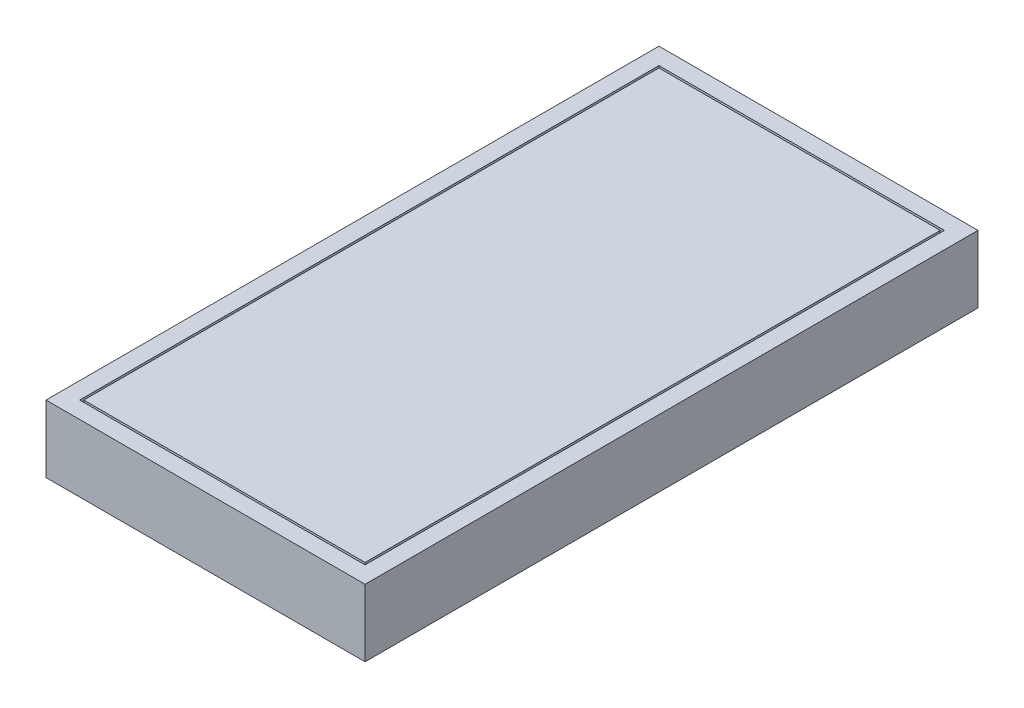
ISO-10303-21;
HEADER;
FILE_DESCRIPTION(('STEP AP214'),'2;1');
FILE_NAME('part.step','',(''),(''),'','','');
FILE_SCHEMA(('AUTOMOTIVE_DESIGN { 1 0 10303 214 1 1 1 1 }'));
ENDSEC;
DATA;
#1=APPLICATION_CONTEXT('core data for automotive mechanical design processes');
#2=APPLICATION_PROTOCOL_DEFINITION('international standard','automotive_design',2000,#1);
#3=PRODUCT_CONTEXT('',#1,'mechanical');
#4=PRODUCT('Part','Part','',(#3));
#5=PRODUCT_RELATED_PRODUCT_CATEGORY('part','',(#4));
#6=PRODUCT_DEFINITION_FORMATION('','',#4);
#7=PRODUCT_DEFINITION_CONTEXT('part definition',#1,'design');
#8=PRODUCT_DEFINITION('design','',#6,#7);
#9=PRODUCT_DEFINITION_SHAPE('','',#8);
#10=(LENGTH_UNIT() NAMED_UNIT(*) SI_UNIT(.MILLI.,.METRE.));
#11=(NAMED_UNIT(*) PLANE_ANGLE_UNIT() SI_UNIT($,.RADIAN.));
#12=(NAMED_UNIT(*) SI_UNIT($,.STERADIAN.) SOLID_ANGLE_UNIT());
#13=UNCERTAINTY_MEASURE_WITH_UNIT(LENGTH_MEASURE(1.E-05),#10,'distance_accuracy_value','');
#14=(GEOMETRIC_REPRESENTATION_CONTEXT(3) GLOBAL_UNCERTAINTY_ASSIGNED_CONTEXT((#13)) GLOBAL_UNIT_ASSIGNED_CONTEXT((#10,
#11,#12)) REPRESENTATION_CONTEXT('',''));
#15=CARTESIAN_POINT('',(0.,0.,0.));
#16=DIRECTION('',(0.,0.,1.));
#17=DIRECTION('',(1.,0.,0.));
#18=AXIS2_PLACEMENT_3D('',#15,#16,#17);
#19=CARTESIAN_POINT('',(0.,8.99999999999999,0.));
#20=DIRECTION('',(0.,1.,0.));
#21=DIRECTION('',(0.,0.,1.));
#22=AXIS2_PLACEMENT_3D('',#19,#20,#21);
#23=PLANE('',#22);
#24=DIRECTION('',(0.,0.,1.));
#25=VECTOR('',#24,1.);
#26=CARTESIAN_POINT('',(-170.,8.99999999999999,20.));
#27=LINE('',#26,#25);
#28=CARTESIAN_POINT('',(-170.,8.99999999999999,20.));
#29=VERTEX_POINT('',#28);
#30=CARTESIAN_POINT('',(-170.,8.99999999999999,710.));
#31=VERTEX_POINT('',#30);
#32=EDGE_CURVE('E156',#29,#31,#27,.T.);
#33=ORIENTED_EDGE('',*,*,#32,.T.);
#34=DIRECTION('',(1.,0.,0.));
#35=VECTOR('',#34,1.);
#36=CARTESIAN_POINT('',(-170.,8.99999999999999,710.));
#37=LINE('',#36,#35);
#38=CARTESIAN_POINT('',(170.,8.99999999999999,710.));
#39=VERTEX_POINT('',#38);
#40=EDGE_CURVE('E159',#31,#39,#37,.T.);
#41=ORIENTED_EDGE('',*,*,#40,.T.);
#42=DIRECTION('',(0.,0.,-1.));
#43=VECTOR('',#42,1.);
#44=CARTESIAN_POINT('',(170.,8.99999999999999,710.));
#45=LINE('',#44,#43);
#46=CARTESIAN_POINT('',(170.,8.99999999999999,20.));
#47=VERTEX_POINT('',#46);
#48=EDGE_CURVE('E163',#39,#47,#45,.T.);
#49=ORIENTED_EDGE('',*,*,#48,.T.);
#50=DIRECTION('',(-1.,0.,0.));
#51=VECTOR('',#50,1.);
#52=CARTESIAN_POINT('',(170.,8.99999999999999,20.));
#53=LINE('',#52,#51);
#54=EDGE_CURVE('E166',#47,#29,#53,.T.);
#55=ORIENTED_EDGE('',*,*,#54,.T.);
#56=EDGE_LOOP('',(#33,#41,#49,#55));
#57=FACE_BOUND('',#56,.T.);
#58=DIRECTION('',(0.,0.,-1.));
#59=VECTOR('',#58,1.);
#60=CARTESIAN_POINT('',(167.5,8.99999999999999,22.5));
#61=LINE('',#60,#59);
#62=CARTESIAN_POINT('',(167.5,8.99999999999999,707.5));
#63=VERTEX_POINT('',#62);
#64=CARTESIAN_POINT('',(167.5,8.99999999999999,22.5));
#65=VERTEX_POINT('',#64);
#66=EDGE_CURVE('E373',#63,#65,#61,.T.);
#67=ORIENTED_EDGE('',*,*,#66,.F.);
#68=DIRECTION('',(1.,0.,0.));
#69=VECTOR('',#68,1.);
#70=CARTESIAN_POINT('',(167.5,8.99999999999999,707.5));
#71=LINE('',#70,#69);
#72=CARTESIAN_POINT('',(-167.5,8.99999999999999,707.5));
#73=VERTEX_POINT('',#72);
#74=EDGE_CURVE('E148',#73,#63,#71,.T.);
#75=ORIENTED_EDGE('',*,*,#74,.F.);
#76=DIRECTION('',(0.,0.,1.));
#77=VECTOR('',#76,1.);
#78=CARTESIAN_POINT('',(-167.5,8.99999999999999,707.5));
#79=LINE('',#78,#77);
#80=CARTESIAN_POINT('',(-167.5,8.99999999999999,22.5));
#81=VERTEX_POINT('',#80);
#82=EDGE_CURVE('E144',#81,#73,#79,.T.);
#83=ORIENTED_EDGE('',*,*,#82,.F.);
#84=DIRECTION('',(-1.,0.,0.));
#85=VECTOR('',#84,1.);
#86=CARTESIAN_POINT('',(-167.5,8.99999999999999,22.5));
#87=LINE('',#86,#85);
#88=EDGE_CURVE('E370',#65,#81,#87,.T.);
#89=ORIENTED_EDGE('',*,*,#88,.F.);
#90=EDGE_LOOP('',(#67,#75,#83,#89));
#91=FACE_BOUND('',#90,.T.);
#92=ADVANCED_FACE('F35',(#57,#91),#23,.T.);
#93=CARTESIAN_POINT('',(-190.,20.,730.));
#94=DIRECTION('',(-1.,0.,0.));
#95=DIRECTION('',(0.,0.,1.));
#96=AXIS2_PLACEMENT_3D('',#93,#94,#95);
#97=PLANE('',#96);
#98=DIRECTION('',(0.,0.,-1.));
#99=VECTOR('',#98,1.);
#100=CARTESIAN_POINT('',(-190.,-60.,730.));
#101=LINE('',#100,#99);
#102=CARTESIAN_POINT('',(-190.,-60.,730.));
#103=VERTEX_POINT('',#102);
#104=CARTESIAN_POINT('',(-190.,-60.,0.));
#105=VERTEX_POINT('',#104);
#106=EDGE_CURVE('E179',#103,#105,#101,.T.);
#107=ORIENTED_EDGE('',*,*,#106,.F.);
#108=DIRECTION('',(0.,-1.,0.));
#109=VECTOR('',#108,1.);
#110=CARTESIAN_POINT('',(-190.,20.,730.));
#111=LINE('',#110,#109);
#112=CARTESIAN_POINT('',(-190.,20.,730.));
#113=VERTEX_POINT('',#112);
#114=EDGE_CURVE('E11',#113,#103,#111,.T.);
#115=ORIENTED_EDGE('',*,*,#114,.F.);
#116=DIRECTION('',(0.,0.,-1.));
#117=VECTOR('',#116,1.);
#118=CARTESIAN_POINT('',(-190.,20.,730.));
#119=LINE('',#118,#117);
#120=CARTESIAN_POINT('',(-190.,20.,0.));
#121=VERTEX_POINT('',#120);
#122=EDGE_CURVE('E185',#113,#121,#119,.T.);
#123=ORIENTED_EDGE('',*,*,#122,.T.);
#124=DIRECTION('',(0.,-1.,0.));
#125=VECTOR('',#124,1.);
#126=CARTESIAN_POINT('',(-190.,20.,0.));
#127=LINE('',#126,#125);
#128=EDGE_CURVE('E39',#121,#105,#127,.T.);
#129=ORIENTED_EDGE('',*,*,#128,.T.);
#130=EDGE_LOOP('',(#107,#115,#123,#129));
#131=FACE_BOUND('',#130,.T.);
#132=ADVANCED_FACE('F37',(#131),#97,.T.);
#133=CARTESIAN_POINT('',(190.,20.,730.));
#134=DIRECTION('',(0.,0.,1.));
#135=DIRECTION('',(1.,0.,0.));
#136=AXIS2_PLACEMENT_3D('',#133,#134,#135);
#137=PLANE('',#136);
#138=DIRECTION('',(-1.,0.,0.));
#139=VECTOR('',#138,1.);
#140=CARTESIAN_POINT('',(190.,-60.,730.));
#141=LINE('',#140,#139);
#142=CARTESIAN_POINT('',(190.,-60.,730.));
#143=VERTEX_POINT('',#142);
#144=EDGE_CURVE('E189',#143,#103,#141,.T.);
#145=ORIENTED_EDGE('',*,*,#144,.F.);
#146=DIRECTION('',(0.,-1.,0.));
#147=VECTOR('',#146,1.);
#148=CARTESIAN_POINT('',(190.,20.,730.));
#149=LINE('',#148,#147);
#150=CARTESIAN_POINT('',(190.,20.,730.));
#151=VERTEX_POINT('',#150);
#152=EDGE_CURVE('E44',#151,#143,#149,.T.);
#153=ORIENTED_EDGE('',*,*,#152,.F.);
#154=DIRECTION('',(-1.,0.,0.));
#155=VECTOR('',#154,1.);
#156=CARTESIAN_POINT('',(190.,20.,730.));
#157=LINE('',#156,#155);
#158=EDGE_CURVE('E195',#151,#113,#157,.T.);
#159=ORIENTED_EDGE('',*,*,#158,.T.);
#160=ORIENTED_EDGE('',*,*,#114,.T.);
#161=EDGE_LOOP('',(#145,#153,#159,#160));
#162=FACE_BOUND('',#161,.T.);
#163=ADVANCED_FACE('F221',(#162),#137,.T.);
#164=CARTESIAN_POINT('',(190.,20.,0.));
#165=DIRECTION('',(1.,0.,0.));
#166=DIRECTION('',(0.,0.,-1.));
#167=AXIS2_PLACEMENT_3D('',#164,#165,#166);
#168=PLANE('',#167);
#169=DIRECTION('',(0.,0.,1.));
#170=VECTOR('',#169,1.);
#171=CARTESIAN_POINT('',(190.,-60.,0.));
#172=LINE('',#171,#170);
#173=CARTESIAN_POINT('',(190.,-60.,0.));
#174=VERTEX_POINT('',#173);
#175=EDGE_CURVE('E203',#174,#143,#172,.T.);
#176=ORIENTED_EDGE('',*,*,#175,.F.);
#177=DIRECTION('',(0.,-1.,0.));
#178=VECTOR('',#177,1.);
#179=CARTESIAN_POINT('',(190.,20.,0.));
#180=LINE('',#179,#178);
#181=CARTESIAN_POINT('',(190.,20.,0.));
#182=VERTEX_POINT('',#181);
#183=EDGE_CURVE('E208',#182,#174,#180,.T.);
#184=ORIENTED_EDGE('',*,*,#183,.F.);
#185=DIRECTION('',(0.,0.,1.));
#186=VECTOR('',#185,1.);
#187=CARTESIAN_POINT('',(190.,20.,0.));
#188=LINE('',#187,#186);
#189=EDGE_CURVE('E192',#182,#151,#188,.T.);
#190=ORIENTED_EDGE('',*,*,#189,.T.);
#191=ORIENTED_EDGE('',*,*,#152,.T.);
#192=EDGE_LOOP('',(#176,#184,#190,#191));
#193=FACE_BOUND('',#192,.T.);
#194=ADVANCED_FACE('F227',(#193),#168,.T.);
#195=CARTESIAN_POINT('',(-190.,20.,0.));
#196=DIRECTION('',(0.,0.,-1.));
#197=DIRECTION('',(-1.,0.,0.));
#198=AXIS2_PLACEMENT_3D('',#195,#196,#197);
#199=PLANE('',#198);
#200=DIRECTION('',(1.,0.,0.));
#201=VECTOR('',#200,1.);
#202=CARTESIAN_POINT('',(-190.,-60.,0.));
#203=LINE('',#202,#201);
#204=EDGE_CURVE('E200',#105,#174,#203,.T.);
#205=ORIENTED_EDGE('',*,*,#204,.F.);
#206=ORIENTED_EDGE('',*,*,#128,.F.);
#207=DIRECTION('',(1.,0.,0.));
#208=VECTOR('',#207,1.);
#209=CARTESIAN_POINT('',(-190.,20.,0.));
#210=LINE('',#209,#208);
#211=EDGE_CURVE('E188',#121,#182,#210,.T.);
#212=ORIENTED_EDGE('',*,*,#211,.T.);
#213=ORIENTED_EDGE('',*,*,#183,.T.);
#214=EDGE_LOOP('',(#205,#206,#212,#213));
#215=FACE_BOUND('',#214,.T.);
#216=ADVANCED_FACE('F216',(#215),#199,.T.);
#217=CARTESIAN_POINT('',(0.,20.,0.));
#218=DIRECTION('',(0.,-1.,0.));
#219=DIRECTION('',(0.,0.,-1.));
#220=AXIS2_PLACEMENT_3D('',#217,#218,#219);
#221=PLANE('',#220);
#222=DIRECTION('',(1.,0.,0.));
#223=VECTOR('',#222,1.);
#224=CARTESIAN_POINT('',(-170.,20.,710.));
#225=LINE('',#224,#223);
#226=CARTESIAN_POINT('',(-170.,20.,710.));
#227=VERTEX_POINT('',#226);
#228=CARTESIAN_POINT('',(170.,20.,710.));
#229=VERTEX_POINT('',#228);
#230=EDGE_CURVE('E151',#227,#229,#225,.T.);
#231=ORIENTED_EDGE('',*,*,#230,.F.);
#232=DIRECTION('',(0.,0.,1.));
#233=VECTOR('',#232,1.);
#234=CARTESIAN_POINT('',(-170.,20.,20.));
#235=LINE('',#234,#233);
#236=CARTESIAN_POINT('',(-170.,20.,20.));
#237=VERTEX_POINT('',#236);
#238=EDGE_CURVE('E60',#237,#227,#235,.T.);
#239=ORIENTED_EDGE('',*,*,#238,.F.);
#240=DIRECTION('',(-1.,0.,0.));
#241=VECTOR('',#240,1.);
#242=CARTESIAN_POINT('',(170.,20.,20.));
#243=LINE('',#242,#241);
#244=CARTESIAN_POINT('',(170.,20.,20.));
#245=VERTEX_POINT('',#244);
#246=EDGE_CURVE('E160',#245,#237,#243,.T.);
#247=ORIENTED_EDGE('',*,*,#246,.F.);
#248=DIRECTION('',(0.,0.,-1.));
#249=VECTOR('',#248,1.);
#250=CARTESIAN_POINT('',(170.,20.,710.));
#251=LINE('',#250,#249);
#252=EDGE_CURVE('E172',#229,#245,#251,.T.);
#253=ORIENTED_EDGE('',*,*,#252,.F.);
#254=EDGE_LOOP('',(#231,#239,#247,#253));
#255=FACE_BOUND('',#254,.T.);
#256=ORIENTED_EDGE('',*,*,#122,.F.);
#257=ORIENTED_EDGE('',*,*,#158,.F.);
#258=ORIENTED_EDGE('',*,*,#189,.F.);
#259=ORIENTED_EDGE('',*,*,#211,.F.);
#260=EDGE_LOOP('',(#256,#257,#258,#259));
#261=FACE_BOUND('',#260,.T.);
#262=ADVANCED_FACE('F224',(#255,#261),#221,.F.);
#263=CARTESIAN_POINT('',(0.,-60.,0.));
#264=DIRECTION('',(0.,-1.,0.));
#265=DIRECTION('',(0.,0.,-1.));
#266=AXIS2_PLACEMENT_3D('',#263,#264,#265);
#267=PLANE('',#266);
#268=ORIENTED_EDGE('',*,*,#106,.T.);
#269=ORIENTED_EDGE('',*,*,#204,.T.);
#270=ORIENTED_EDGE('',*,*,#175,.T.);
#271=ORIENTED_EDGE('',*,*,#144,.T.);
#272=EDGE_LOOP('',(#268,#269,#270,#271));
#273=FACE_BOUND('',#272,.T.);
#274=ADVANCED_FACE('F218',(#273),#267,.T.);
#275=CARTESIAN_POINT('',(-170.,8.99999999999999,20.));
#276=DIRECTION('',(-1.,0.,0.));
#277=DIRECTION('',(0.,0.,1.));
#278=AXIS2_PLACEMENT_3D('',#275,#276,#277);
#279=PLANE('',#278);
#280=ORIENTED_EDGE('',*,*,#238,.T.);
#281=DIRECTION('',(0.,1.,0.));
#282=VECTOR('',#281,1.);
#283=CARTESIAN_POINT('',(-170.,8.99999999999999,710.));
#284=LINE('',#283,#282);
#285=EDGE_CURVE('E168',#31,#227,#284,.T.);
#286=ORIENTED_EDGE('',*,*,#285,.F.);
#287=ORIENTED_EDGE('',*,*,#32,.F.);
#288=DIRECTION('',(0.,1.,0.));
#289=VECTOR('',#288,1.);
#290=CARTESIAN_POINT('',(-170.,8.99999999999999,20.));
#291=LINE('',#290,#289);
#292=EDGE_CURVE('E177',#29,#237,#291,.T.);
#293=ORIENTED_EDGE('',*,*,#292,.T.);
#294=EDGE_LOOP('',(#280,#286,#287,#293));
#295=FACE_BOUND('',#294,.T.);
#296=ADVANCED_FACE('F249',(#295),#279,.F.);
#297=CARTESIAN_POINT('',(170.,8.99999999999999,20.));
#298=DIRECTION('',(0.,0.,-1.));
#299=DIRECTION('',(-1.,0.,0.));
#300=AXIS2_PLACEMENT_3D('',#297,#298,#299);
#301=PLANE('',#300);
#302=ORIENTED_EDGE('',*,*,#246,.T.);
#303=ORIENTED_EDGE('',*,*,#292,.F.);
#304=ORIENTED_EDGE('',*,*,#54,.F.);
#305=DIRECTION('',(0.,1.,0.));
#306=VECTOR('',#305,1.);
#307=CARTESIAN_POINT('',(170.,8.99999999999999,20.));
#308=LINE('',#307,#306);
#309=EDGE_CURVE('E180',#47,#245,#308,.T.);
#310=ORIENTED_EDGE('',*,*,#309,.T.);
#311=EDGE_LOOP('',(#302,#303,#304,#310));
#312=FACE_BOUND('',#311,.T.);
#313=ADVANCED_FACE('F245',(#312),#301,.F.);
#314=CARTESIAN_POINT('',(170.,8.99999999999999,710.));
#315=DIRECTION('',(1.,0.,0.));
#316=DIRECTION('',(0.,0.,-1.));
#317=AXIS2_PLACEMENT_3D('',#314,#315,#316);
#318=PLANE('',#317);
#319=ORIENTED_EDGE('',*,*,#252,.T.);
#320=ORIENTED_EDGE('',*,*,#309,.F.);
#321=ORIENTED_EDGE('',*,*,#48,.F.);
#322=DIRECTION('',(0.,1.,0.));
#323=VECTOR('',#322,1.);
#324=CARTESIAN_POINT('',(170.,8.99999999999999,710.));
#325=LINE('',#324,#323);
#326=EDGE_CURVE('E182',#39,#229,#325,.T.);
#327=ORIENTED_EDGE('',*,*,#326,.T.);
#328=EDGE_LOOP('',(#319,#320,#321,#327));
#329=FACE_BOUND('',#328,.T.);
#330=ADVANCED_FACE('F248',(#329),#318,.F.);
#331=CARTESIAN_POINT('',(-170.,8.99999999999999,710.));
#332=DIRECTION('',(0.,0.,1.));
#333=DIRECTION('',(1.,0.,0.));
#334=AXIS2_PLACEMENT_3D('',#331,#332,#333);
#335=PLANE('',#334);
#336=ORIENTED_EDGE('',*,*,#230,.T.);
#337=ORIENTED_EDGE('',*,*,#326,.F.);
#338=ORIENTED_EDGE('',*,*,#40,.F.);
#339=ORIENTED_EDGE('',*,*,#285,.T.);
#340=EDGE_LOOP('',(#336,#337,#338,#339));
#341=FACE_BOUND('',#340,.T.);
#342=ADVANCED_FACE('F253',(#341),#335,.F.);
#343=CARTESIAN_POINT('',(167.5,20.,707.5));
#344=DIRECTION('',(0.,0.,-1.));
#345=DIRECTION('',(-1.,0.,0.));
#346=AXIS2_PLACEMENT_3D('',#343,#344,#345);
#347=PLANE('',#346);
#348=ORIENTED_EDGE('',*,*,#74,.T.);
#349=DIRECTION('',(0.,-1.,0.));
#350=VECTOR('',#349,1.);
#351=CARTESIAN_POINT('',(167.5,20.,707.5));
#352=LINE('',#351,#350);
#353=CARTESIAN_POINT('',(167.5,20.,707.5));
#354=VERTEX_POINT('',#353);
#355=EDGE_CURVE('E129',#354,#63,#352,.T.);
#356=ORIENTED_EDGE('',*,*,#355,.F.);
#357=DIRECTION('',(1.,0.,0.));
#358=VECTOR('',#357,1.);
#359=CARTESIAN_POINT('',(167.5,20.,707.5));
#360=LINE('',#359,#358);
#361=CARTESIAN_POINT('',(-167.5,20.,707.5));
#362=VERTEX_POINT('',#361);
#363=EDGE_CURVE('E136',#362,#354,#360,.T.);
#364=ORIENTED_EDGE('',*,*,#363,.F.);
#365=DIRECTION('',(0.,-1.,0.));
#366=VECTOR('',#365,1.);
#367=CARTESIAN_POINT('',(-167.5,20.,707.5));
#368=LINE('',#367,#366);
#369=EDGE_CURVE('E368',#362,#73,#368,.T.);
#370=ORIENTED_EDGE('',*,*,#369,.T.);
#371=EDGE_LOOP('',(#348,#356,#364,#370));
#372=FACE_BOUND('',#371,.T.);
#373=ADVANCED_FACE('F146',(#372),#347,.F.);
#374=CARTESIAN_POINT('',(167.5,20.,22.5));
#375=DIRECTION('',(-1.,0.,0.));
#376=DIRECTION('',(0.,0.,1.));
#377=AXIS2_PLACEMENT_3D('',#374,#375,#376);
#378=PLANE('',#377);
#379=ORIENTED_EDGE('',*,*,#66,.T.);
#380=DIRECTION('',(0.,-1.,0.));
#381=VECTOR('',#380,1.);
#382=CARTESIAN_POINT('',(167.5,20.,22.5));
#383=LINE('',#382,#381);
#384=CARTESIAN_POINT('',(167.5,20.,22.5));
#385=VERTEX_POINT('',#384);
#386=EDGE_CURVE('E132',#385,#65,#383,.T.);
#387=ORIENTED_EDGE('',*,*,#386,.F.);
#388=DIRECTION('',(0.,0.,-1.));
#389=VECTOR('',#388,1.);
#390=CARTESIAN_POINT('',(167.5,20.,22.5));
#391=LINE('',#390,#389);
#392=EDGE_CURVE('E125',#354,#385,#391,.T.);
#393=ORIENTED_EDGE('',*,*,#392,.F.);
#394=ORIENTED_EDGE('',*,*,#355,.T.);
#395=EDGE_LOOP('',(#379,#387,#393,#394));
#396=FACE_BOUND('',#395,.T.);
#397=ADVANCED_FACE('F127',(#396),#378,.F.);
#398=CARTESIAN_POINT('',(-167.5,20.,22.5));
#399=DIRECTION('',(0.,0.,1.));
#400=DIRECTION('',(1.,0.,0.));
#401=AXIS2_PLACEMENT_3D('',#398,#399,#400);
#402=PLANE('',#401);
#403=ORIENTED_EDGE('',*,*,#88,.T.);
#404=DIRECTION('',(0.,-1.,0.));
#405=VECTOR('',#404,1.);
#406=CARTESIAN_POINT('',(-167.5,20.,22.5));
#407=LINE('',#406,#405);
#408=CARTESIAN_POINT('',(-167.5,20.,22.5));
#409=VERTEX_POINT('',#408);
#410=EDGE_CURVE('E52',#409,#81,#407,.T.);
#411=ORIENTED_EDGE('',*,*,#410,.F.);
#412=DIRECTION('',(-1.,0.,0.));
#413=VECTOR('',#412,1.);
#414=CARTESIAN_POINT('',(-167.5,20.,22.5));
#415=LINE('',#414,#413);
#416=EDGE_CURVE('E135',#385,#409,#415,.T.);
#417=ORIENTED_EDGE('',*,*,#416,.F.);
#418=ORIENTED_EDGE('',*,*,#386,.T.);
#419=EDGE_LOOP('',(#403,#411,#417,#418));
#420=FACE_BOUND('',#419,.T.);
#421=ADVANCED_FACE('F296',(#420),#402,.F.);
#422=CARTESIAN_POINT('',(-167.5,20.,707.5));
#423=DIRECTION('',(1.,0.,0.));
#424=DIRECTION('',(0.,0.,-1.));
#425=AXIS2_PLACEMENT_3D('',#422,#423,#424);
#426=PLANE('',#425);
#427=ORIENTED_EDGE('',*,*,#82,.T.);
#428=ORIENTED_EDGE('',*,*,#369,.F.);
#429=DIRECTION('',(0.,0.,1.));
#430=VECTOR('',#429,1.);
#431=CARTESIAN_POINT('',(-167.5,20.,707.5));
#432=LINE('',#431,#430);
#433=EDGE_CURVE('E140',#409,#362,#432,.T.);
#434=ORIENTED_EDGE('',*,*,#433,.F.);
#435=ORIENTED_EDGE('',*,*,#410,.T.);
#436=EDGE_LOOP('',(#427,#428,#434,#435));
#437=FACE_BOUND('',#436,.T.);
#438=ADVANCED_FACE('F302',(#437),#426,.F.);
#439=CARTESIAN_POINT('',(0.,20.,0.));
#440=DIRECTION('',(0.,-1.,0.));
#441=DIRECTION('',(0.,0.,-1.));
#442=AXIS2_PLACEMENT_3D('',#439,#440,#441);
#443=PLANE('',#442);
#444=ORIENTED_EDGE('',*,*,#363,.T.);
#445=ORIENTED_EDGE('',*,*,#392,.T.);
#446=ORIENTED_EDGE('',*,*,#416,.T.);
#447=ORIENTED_EDGE('',*,*,#433,.T.);
#448=EDGE_LOOP('',(#444,#445,#446,#447));
#449=FACE_BOUND('',#448,.T.);
#450=ADVANCED_FACE('F139',(#449),#443,.F.);
#451=CLOSED_SHELL('',(#92,#132,#163,#194,#216,#262,#274,#296,#313,#330,#342,#373,#397,#421,#438,#450));
#452=MANIFOLD_SOLID_BREP('B2',#451);
#453=ADVANCED_BREP_SHAPE_REPRESENTATION('',(#18,#452),#14);
#454=SHAPE_DEFINITION_REPRESENTATION(#9,#453);
ENDSEC;
END-ISO-10303-21;
